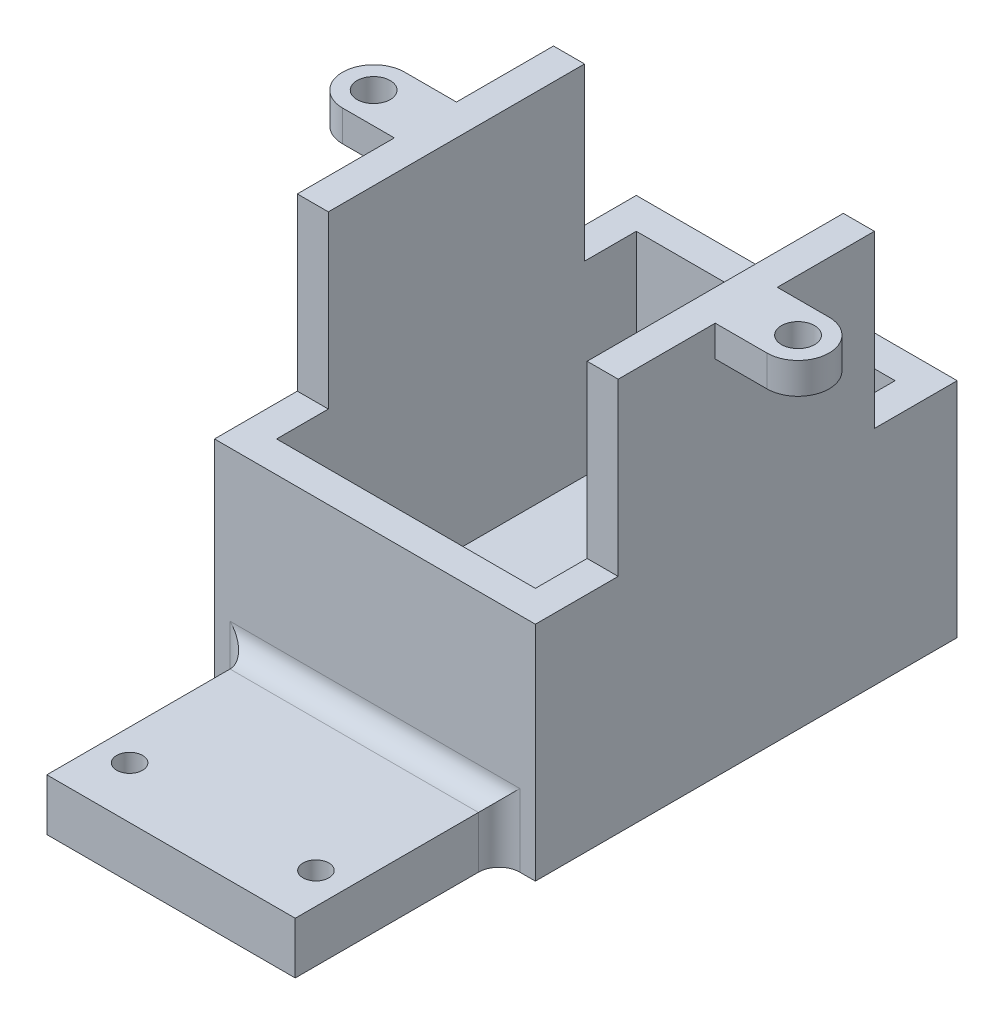
ISO-10303-21;
HEADER;
FILE_DESCRIPTION(('STEP AP214'),'2;1');
FILE_NAME('part.step','',(''),(''),'','','');
FILE_SCHEMA(('AUTOMOTIVE_DESIGN { 1 0 10303 214 1 1 1 1 }'));
ENDSEC;
DATA;
#1=APPLICATION_CONTEXT('core data for automotive mechanical design processes');
#2=APPLICATION_PROTOCOL_DEFINITION('international standard','automotive_design',2000,#1);
#3=PRODUCT_CONTEXT('',#1,'mechanical');
#4=PRODUCT('Part','Part','',(#3));
#5=PRODUCT_RELATED_PRODUCT_CATEGORY('part','',(#4));
#6=PRODUCT_DEFINITION_FORMATION('','',#4);
#7=PRODUCT_DEFINITION_CONTEXT('part definition',#1,'design');
#8=PRODUCT_DEFINITION('design','',#6,#7);
#9=PRODUCT_DEFINITION_SHAPE('','',#8);
#10=(LENGTH_UNIT() NAMED_UNIT(*) SI_UNIT(.MILLI.,.METRE.));
#11=(NAMED_UNIT(*) PLANE_ANGLE_UNIT() SI_UNIT($,.RADIAN.));
#12=(NAMED_UNIT(*) SI_UNIT($,.STERADIAN.) SOLID_ANGLE_UNIT());
#13=UNCERTAINTY_MEASURE_WITH_UNIT(LENGTH_MEASURE(1.E-05),#10,'distance_accuracy_value','');
#14=(GEOMETRIC_REPRESENTATION_CONTEXT(3) GLOBAL_UNCERTAINTY_ASSIGNED_CONTEXT((#13)) GLOBAL_UNIT_ASSIGNED_CONTEXT((#10,
#11,#12)) REPRESENTATION_CONTEXT('',''));
#15=CARTESIAN_POINT('',(0.,0.,0.));
#16=DIRECTION('',(0.,0.,1.));
#17=DIRECTION('',(1.,0.,0.));
#18=AXIS2_PLACEMENT_3D('',#15,#16,#17);
#19=CARTESIAN_POINT('',(0.,38.,-40.75));
#20=DIRECTION('',(0.,1.,0.));
#21=DIRECTION('',(0.,0.,1.));
#22=AXIS2_PLACEMENT_3D('',#19,#20,#21);
#23=PLANE('',#22);
#24=CARTESIAN_POINT('',(-5.,38.,-20.375));
#25=DIRECTION('',(0.,1.,0.));
#26=DIRECTION('',(0.,0.,-1.));
#27=AXIS2_PLACEMENT_3D('',#24,#25,#26);
#28=CIRCLE('',#27,1.6);
#29=CARTESIAN_POINT('',(-5.,38.,-21.975));
#30=VERTEX_POINT('',#29);
#31=EDGE_CURVE('E329',#30,#30,#28,.T.);
#32=ORIENTED_EDGE('',*,*,#31,.F.);
#33=EDGE_LOOP('',(#32));
#34=FACE_BOUND('',#33,.T.);
#35=DIRECTION('',(0.,0.,1.));
#36=VECTOR('',#35,1.);
#37=CARTESIAN_POINT('',(0.,38.,-40.75));
#38=LINE('',#37,#36);
#39=CARTESIAN_POINT('',(0.,38.,-17.375));
#40=VERTEX_POINT('',#39);
#41=CARTESIAN_POINT('',(0.,38.,-8.));
#42=VERTEX_POINT('',#41);
#43=EDGE_CURVE('E524',#40,#42,#38,.T.);
#44=ORIENTED_EDGE('',*,*,#43,.T.);
#45=DIRECTION('',(-1.,0.,0.));
#46=VECTOR('',#45,1.);
#47=CARTESIAN_POINT('',(0.,38.,-8.));
#48=LINE('',#47,#46);
#49=CARTESIAN_POINT('',(3.,38.,-8.));
#50=VERTEX_POINT('',#49);
#51=EDGE_CURVE('E254',#50,#42,#48,.T.);
#52=ORIENTED_EDGE('',*,*,#51,.F.);
#53=DIRECTION('',(0.,0.,1.));
#54=VECTOR('',#53,1.);
#55=CARTESIAN_POINT('',(3.,38.,-3.00000000000003));
#56=LINE('',#55,#54);
#57=CARTESIAN_POINT('',(2.99999999999999,38.,-32.75));
#58=VERTEX_POINT('',#57);
#59=EDGE_CURVE('E432',#58,#50,#56,.T.);
#60=ORIENTED_EDGE('',*,*,#59,.F.);
#61=DIRECTION('',(1.,0.,0.));
#62=VECTOR('',#61,1.);
#63=CARTESIAN_POINT('',(-9.75,38.,-32.75));
#64=LINE('',#63,#62);
#65=CARTESIAN_POINT('',(0.,38.,-32.75));
#66=VERTEX_POINT('',#65);
#67=EDGE_CURVE('E487',#66,#58,#64,.T.);
#68=ORIENTED_EDGE('',*,*,#67,.F.);
#69=CARTESIAN_POINT('',(0.,38.,-23.375));
#70=VERTEX_POINT('',#69);
#71=EDGE_CURVE('E519',#66,#70,#38,.T.);
#72=ORIENTED_EDGE('',*,*,#71,.T.);
#73=DIRECTION('',(-1.,0.,0.));
#74=VECTOR('',#73,1.);
#75=CARTESIAN_POINT('',(-5.,38.,-23.375));
#76=LINE('',#75,#74);
#77=CARTESIAN_POINT('',(-5.,38.,-23.375));
#78=VERTEX_POINT('',#77);
#79=EDGE_CURVE('E334',#70,#78,#76,.T.);
#80=ORIENTED_EDGE('',*,*,#79,.T.);
#81=CARTESIAN_POINT('',(-5.,38.,-20.375));
#82=DIRECTION('',(0.,1.,0.));
#83=DIRECTION('',(0.,0.,-1.));
#84=AXIS2_PLACEMENT_3D('',#81,#82,#83);
#85=CIRCLE('',#84,3.);
#86=CARTESIAN_POINT('',(-5.,38.,-17.375));
#87=VERTEX_POINT('',#86);
#88=EDGE_CURVE('E358',#78,#87,#85,.T.);
#89=ORIENTED_EDGE('',*,*,#88,.T.);
#90=DIRECTION('',(1.,0.,0.));
#91=VECTOR('',#90,1.);
#92=CARTESIAN_POINT('',(0.,38.,-17.375));
#93=LINE('',#92,#91);
#94=EDGE_CURVE('E343',#87,#40,#93,.T.);
#95=ORIENTED_EDGE('',*,*,#94,.T.);
#96=EDGE_LOOP('',(#44,#52,#60,#68,#72,#80,#89,#95));
#97=FACE_BOUND('',#96,.T.);
#98=ADVANCED_FACE('F38',(#34,#97),#23,.T.);
#99=CARTESIAN_POINT('',(36.,38.,-20.375));
#100=DIRECTION('',(0.,1.,0.));
#101=DIRECTION('',(0.,0.,1.));
#102=AXIS2_PLACEMENT_3D('',#99,#100,#101);
#103=CIRCLE('',#102,1.6);
#104=CARTESIAN_POINT('',(36.,38.,-18.775));
#105=VERTEX_POINT('',#104);
#106=EDGE_CURVE('E369',#105,#105,#103,.T.);
#107=ORIENTED_EDGE('',*,*,#106,.F.);
#108=EDGE_LOOP('',(#107));
#109=FACE_BOUND('',#108,.T.);
#110=DIRECTION('',(0.,0.,-1.));
#111=VECTOR('',#110,1.);
#112=CARTESIAN_POINT('',(28.,38.,-3.00000000000003));
#113=LINE('',#112,#111);
#114=CARTESIAN_POINT('',(28.,38.,-8.));
#115=VERTEX_POINT('',#114);
#116=CARTESIAN_POINT('',(28.,38.,-32.75));
#117=VERTEX_POINT('',#116);
#118=EDGE_CURVE('E417',#115,#117,#113,.T.);
#119=ORIENTED_EDGE('',*,*,#118,.F.);
#120=CARTESIAN_POINT('',(31.,38.,-8.));
#121=VERTEX_POINT('',#120);
#122=EDGE_CURVE('E267',#121,#115,#48,.T.);
#123=ORIENTED_EDGE('',*,*,#122,.F.);
#124=DIRECTION('',(0.,0.,1.));
#125=VECTOR('',#124,1.);
#126=CARTESIAN_POINT('',(31.,38.,-40.75));
#127=LINE('',#126,#125);
#128=CARTESIAN_POINT('',(31.,38.,-17.375));
#129=VERTEX_POINT('',#128);
#130=EDGE_CURVE('E529',#129,#121,#127,.T.);
#131=ORIENTED_EDGE('',*,*,#130,.F.);
#132=DIRECTION('',(1.,0.,0.));
#133=VECTOR('',#132,1.);
#134=CARTESIAN_POINT('',(31.,38.,-17.375));
#135=LINE('',#134,#133);
#136=CARTESIAN_POINT('',(36.,38.,-17.375));
#137=VERTEX_POINT('',#136);
#138=EDGE_CURVE('E391',#129,#137,#135,.T.);
#139=ORIENTED_EDGE('',*,*,#138,.T.);
#140=CARTESIAN_POINT('',(36.,38.,-20.375));
#141=DIRECTION('',(0.,1.,0.));
#142=DIRECTION('',(0.,0.,1.));
#143=AXIS2_PLACEMENT_3D('',#140,#141,#142);
#144=CIRCLE('',#143,3.);
#145=CARTESIAN_POINT('',(36.,38.,-23.375));
#146=VERTEX_POINT('',#145);
#147=EDGE_CURVE('E382',#137,#146,#144,.T.);
#148=ORIENTED_EDGE('',*,*,#147,.T.);
#149=DIRECTION('',(-1.,0.,0.));
#150=VECTOR('',#149,1.);
#151=CARTESIAN_POINT('',(36.,38.,-23.375));
#152=LINE('',#151,#150);
#153=CARTESIAN_POINT('',(31.,38.,-23.375));
#154=VERTEX_POINT('',#153);
#155=EDGE_CURVE('E407',#146,#154,#152,.T.);
#156=ORIENTED_EDGE('',*,*,#155,.T.);
#157=CARTESIAN_POINT('',(31.,38.,-32.75));
#158=VERTEX_POINT('',#157);
#159=EDGE_CURVE('E525',#158,#154,#127,.T.);
#160=ORIENTED_EDGE('',*,*,#159,.F.);
#161=EDGE_CURVE('E480',#117,#158,#64,.T.);
#162=ORIENTED_EDGE('',*,*,#161,.F.);
#163=EDGE_LOOP('',(#119,#123,#131,#139,#148,#156,#160,#162));
#164=FACE_BOUND('',#163,.T.);
#165=ADVANCED_FACE('F656',(#109,#164),#23,.T.);
#166=CARTESIAN_POINT('',(0.,0.,0.));
#167=DIRECTION('',(0.,0.,-1.));
#168=DIRECTION('',(-1.,0.,0.));
#169=AXIS2_PLACEMENT_3D('',#166,#167,#168);
#170=PLANE('',#169);
#171=DIRECTION('',(0.,1.,0.));
#172=VECTOR('',#171,1.);
#173=CARTESIAN_POINT('',(31.,0.,0.));
#174=LINE('',#173,#172);
#175=CARTESIAN_POINT('',(31.,0.,0.));
#176=VERTEX_POINT('',#175);
#177=CARTESIAN_POINT('',(31.,21.5,0.));
#178=VERTEX_POINT('',#177);
#179=EDGE_CURVE('E500',#176,#178,#174,.T.);
#180=ORIENTED_EDGE('',*,*,#179,.T.);
#181=DIRECTION('',(1.,0.,0.));
#182=VECTOR('',#181,1.);
#183=CARTESIAN_POINT('',(0.,21.5,0.));
#184=LINE('',#183,#182);
#185=CARTESIAN_POINT('',(0.,21.5,0.));
#186=VERTEX_POINT('',#185);
#187=EDGE_CURVE('E259',#186,#178,#184,.T.);
#188=ORIENTED_EDGE('',*,*,#187,.F.);
#189=DIRECTION('',(0.,-1.,0.));
#190=VECTOR('',#189,1.);
#191=CARTESIAN_POINT('',(0.,0.,0.));
#192=LINE('',#191,#190);
#193=CARTESIAN_POINT('',(0.,0.,0.));
#194=VERTEX_POINT('',#193);
#195=EDGE_CURVE('E264',#186,#194,#192,.T.);
#196=ORIENTED_EDGE('',*,*,#195,.T.);
#197=DIRECTION('',(1.,0.,0.));
#198=VECTOR('',#197,1.);
#199=CARTESIAN_POINT('',(0.,0.,0.));
#200=LINE('',#199,#198);
#201=CARTESIAN_POINT('',(1.5,0.,0.));
#202=VERTEX_POINT('',#201);
#203=EDGE_CURVE('E512',#194,#202,#200,.T.);
#204=ORIENTED_EDGE('',*,*,#203,.T.);
#205=DIRECTION('',(0.,-1.,0.));
#206=VECTOR('',#205,1.);
#207=CARTESIAN_POINT('',(1.5,5.,0.));
#208=LINE('',#207,#206);
#209=CARTESIAN_POINT('',(1.5,7.,0.));
#210=VERTEX_POINT('',#209);
#211=EDGE_CURVE('E560',#202,#210,#208,.F.);
#212=ORIENTED_EDGE('',*,*,#211,.T.);
#213=DIRECTION('',(-1.,0.,0.));
#214=VECTOR('',#213,1.);
#215=CARTESIAN_POINT('',(27.5,7.,0.));
#216=LINE('',#215,#214);
#217=CARTESIAN_POINT('',(29.5,7.,0.));
#218=VERTEX_POINT('',#217);
#219=EDGE_CURVE('E557',#210,#218,#216,.F.);
#220=ORIENTED_EDGE('',*,*,#219,.T.);
#221=DIRECTION('',(0.,1.,0.));
#222=VECTOR('',#221,1.);
#223=CARTESIAN_POINT('',(29.5,0.,0.));
#224=LINE('',#223,#222);
#225=CARTESIAN_POINT('',(29.5,0.,0.));
#226=VERTEX_POINT('',#225);
#227=EDGE_CURVE('E554',#218,#226,#224,.F.);
#228=ORIENTED_EDGE('',*,*,#227,.T.);
#229=EDGE_CURVE('E511',#226,#176,#200,.T.);
#230=ORIENTED_EDGE('',*,*,#229,.T.);
#231=EDGE_LOOP('',(#180,#188,#196,#204,#212,#220,#228,#230));
#232=FACE_BOUND('',#231,.T.);
#233=ADVANCED_FACE('F607',(#232),#170,.F.);
#234=CARTESIAN_POINT('',(-9.75,38.,-32.75));
#235=DIRECTION('',(0.,0.,1.));
#236=DIRECTION('',(0.,-1.,0.));
#237=AXIS2_PLACEMENT_3D('',#234,#235,#236);
#238=PLANE('',#237);
#239=DIRECTION('',(1.,0.,0.));
#240=VECTOR('',#239,1.);
#241=CARTESIAN_POINT('',(-9.75,21.5,-32.75));
#242=LINE('',#241,#240);
#243=CARTESIAN_POINT('',(28.,21.5,-32.75));
#244=VERTEX_POINT('',#243);
#245=CARTESIAN_POINT('',(31.,21.5,-32.75));
#246=VERTEX_POINT('',#245);
#247=EDGE_CURVE('E486',#244,#246,#242,.T.);
#248=ORIENTED_EDGE('',*,*,#247,.F.);
#249=DIRECTION('',(0.,1.,0.));
#250=VECTOR('',#249,1.);
#251=CARTESIAN_POINT('',(28.,38.,-32.75));
#252=LINE('',#251,#250);
#253=EDGE_CURVE('E542',#244,#117,#252,.T.);
#254=ORIENTED_EDGE('',*,*,#253,.T.);
#255=ORIENTED_EDGE('',*,*,#161,.T.);
#256=DIRECTION('',(0.,-1.,0.));
#257=VECTOR('',#256,1.);
#258=CARTESIAN_POINT('',(31.,38.,-32.75));
#259=LINE('',#258,#257);
#260=EDGE_CURVE('E473',#158,#246,#259,.T.);
#261=ORIENTED_EDGE('',*,*,#260,.T.);
#262=EDGE_LOOP('',(#248,#254,#255,#261));
#263=FACE_BOUND('',#262,.T.);
#264=ADVANCED_FACE('F651',(#263),#238,.F.);
#265=CARTESIAN_POINT('',(0.,0.,-40.75));
#266=DIRECTION('',(-1.,0.,0.));
#267=DIRECTION('',(0.,0.,1.));
#268=AXIS2_PLACEMENT_3D('',#265,#266,#267);
#269=PLANE('',#268);
#270=DIRECTION('',(0.,0.,1.));
#271=VECTOR('',#270,1.);
#272=CARTESIAN_POINT('',(0.,21.5,-8.));
#273=LINE('',#272,#271);
#274=CARTESIAN_POINT('',(0.,21.5,-8.));
#275=VERTEX_POINT('',#274);
#276=EDGE_CURVE('E240',#275,#186,#273,.T.);
#277=ORIENTED_EDGE('',*,*,#276,.F.);
#278=DIRECTION('',(0.,-1.,0.));
#279=VECTOR('',#278,1.);
#280=CARTESIAN_POINT('',(0.,38.,-8.));
#281=LINE('',#280,#279);
#282=EDGE_CURVE('E251',#42,#275,#281,.T.);
#283=ORIENTED_EDGE('',*,*,#282,.F.);
#284=ORIENTED_EDGE('',*,*,#43,.F.);
#285=DIRECTION('',(0.,1.,0.));
#286=VECTOR('',#285,1.);
#287=CARTESIAN_POINT('',(0.,35.,-17.375));
#288=LINE('',#287,#286);
#289=CARTESIAN_POINT('',(0.,35.,-17.375));
#290=VERTEX_POINT('',#289);
#291=EDGE_CURVE('E370',#290,#40,#288,.T.);
#292=ORIENTED_EDGE('',*,*,#291,.F.);
#293=DIRECTION('',(0.,0.,-1.));
#294=VECTOR('',#293,1.);
#295=CARTESIAN_POINT('',(0.,35.,-23.375));
#296=LINE('',#295,#294);
#297=CARTESIAN_POINT('',(0.,35.,-23.375));
#298=VERTEX_POINT('',#297);
#299=EDGE_CURVE('E350',#290,#298,#296,.T.);
#300=ORIENTED_EDGE('',*,*,#299,.T.);
#301=DIRECTION('',(0.,1.,0.));
#302=VECTOR('',#301,1.);
#303=CARTESIAN_POINT('',(0.,35.,-23.375));
#304=LINE('',#303,#302);
#305=EDGE_CURVE('E365',#298,#70,#304,.T.);
#306=ORIENTED_EDGE('',*,*,#305,.T.);
#307=ORIENTED_EDGE('',*,*,#71,.F.);
#308=DIRECTION('',(0.,1.,0.));
#309=VECTOR('',#308,1.);
#310=CARTESIAN_POINT('',(0.,0.,-32.75));
#311=LINE('',#310,#309);
#312=CARTESIAN_POINT('',(0.,21.5,-32.75));
#313=VERTEX_POINT('',#312);
#314=EDGE_CURVE('E493',#313,#66,#311,.T.);
#315=ORIENTED_EDGE('',*,*,#314,.F.);
#316=DIRECTION('',(0.,0.,1.));
#317=VECTOR('',#316,1.);
#318=CARTESIAN_POINT('',(0.,21.5,-40.75));
#319=LINE('',#318,#317);
#320=CARTESIAN_POINT('',(0.,21.5,-40.75));
#321=VERTEX_POINT('',#320);
#322=EDGE_CURVE('E485',#321,#313,#319,.T.);
#323=ORIENTED_EDGE('',*,*,#322,.F.);
#324=DIRECTION('',(0.,-1.,0.));
#325=VECTOR('',#324,1.);
#326=CARTESIAN_POINT('',(0.,0.,-40.75));
#327=LINE('',#326,#325);
#328=CARTESIAN_POINT('',(0.,0.,-40.75));
#329=VERTEX_POINT('',#328);
#330=EDGE_CURVE('E496',#321,#329,#327,.T.);
#331=ORIENTED_EDGE('',*,*,#330,.T.);
#332=DIRECTION('',(0.,0.,1.));
#333=VECTOR('',#332,1.);
#334=CARTESIAN_POINT('',(0.,0.,-40.75));
#335=LINE('',#334,#333);
#336=EDGE_CURVE('E508',#329,#194,#335,.T.);
#337=ORIENTED_EDGE('',*,*,#336,.T.);
#338=ORIENTED_EDGE('',*,*,#195,.F.);
#339=EDGE_LOOP('',(#277,#283,#284,#292,#300,#306,#307,#315,#323,#331,#337,#338));
#340=FACE_BOUND('',#339,.T.);
#341=ADVANCED_FACE('F262',(#340),#269,.T.);
#342=CARTESIAN_POINT('',(31.,0.,-40.75));
#343=DIRECTION('',(1.,0.,0.));
#344=DIRECTION('',(0.,0.,-1.));
#345=AXIS2_PLACEMENT_3D('',#342,#343,#344);
#346=PLANE('',#345);
#347=DIRECTION('',(0.,0.,1.));
#348=VECTOR('',#347,1.);
#349=CARTESIAN_POINT('',(31.,21.5,-8.));
#350=LINE('',#349,#348);
#351=CARTESIAN_POINT('',(31.,21.5,-8.));
#352=VERTEX_POINT('',#351);
#353=EDGE_CURVE('E266',#352,#178,#350,.T.);
#354=ORIENTED_EDGE('',*,*,#353,.T.);
#355=ORIENTED_EDGE('',*,*,#179,.F.);
#356=DIRECTION('',(0.,0.,1.));
#357=VECTOR('',#356,1.);
#358=CARTESIAN_POINT('',(31.,0.,-40.75));
#359=LINE('',#358,#357);
#360=CARTESIAN_POINT('',(31.,0.,-40.75));
#361=VERTEX_POINT('',#360);
#362=EDGE_CURVE('E530',#361,#176,#359,.T.);
#363=ORIENTED_EDGE('',*,*,#362,.F.);
#364=DIRECTION('',(0.,1.,0.));
#365=VECTOR('',#364,1.);
#366=CARTESIAN_POINT('',(31.,0.,-40.75));
#367=LINE('',#366,#365);
#368=CARTESIAN_POINT('',(31.,21.5,-40.75));
#369=VERTEX_POINT('',#368);
#370=EDGE_CURVE('E504',#361,#369,#367,.T.);
#371=ORIENTED_EDGE('',*,*,#370,.T.);
#372=DIRECTION('',(0.,0.,-1.));
#373=VECTOR('',#372,1.);
#374=CARTESIAN_POINT('',(31.,21.5,-40.75));
#375=LINE('',#374,#373);
#376=EDGE_CURVE('E477',#246,#369,#375,.T.);
#377=ORIENTED_EDGE('',*,*,#376,.F.);
#378=ORIENTED_EDGE('',*,*,#260,.F.);
#379=ORIENTED_EDGE('',*,*,#159,.T.);
#380=DIRECTION('',(0.,1.,0.));
#381=VECTOR('',#380,1.);
#382=CARTESIAN_POINT('',(31.,35.,-23.375));
#383=LINE('',#382,#381);
#384=CARTESIAN_POINT('',(31.,35.,-23.375));
#385=VERTEX_POINT('',#384);
#386=EDGE_CURVE('E422',#385,#154,#383,.T.);
#387=ORIENTED_EDGE('',*,*,#386,.F.);
#388=DIRECTION('',(0.,0.,1.));
#389=VECTOR('',#388,1.);
#390=CARTESIAN_POINT('',(31.,35.,-23.375));
#391=LINE('',#390,#389);
#392=CARTESIAN_POINT('',(31.,35.,-17.375));
#393=VERTEX_POINT('',#392);
#394=EDGE_CURVE('E395',#385,#393,#391,.T.);
#395=ORIENTED_EDGE('',*,*,#394,.T.);
#396=DIRECTION('',(0.,1.,0.));
#397=VECTOR('',#396,1.);
#398=CARTESIAN_POINT('',(31.,35.,-17.375));
#399=LINE('',#398,#397);
#400=EDGE_CURVE('E418',#393,#129,#399,.T.);
#401=ORIENTED_EDGE('',*,*,#400,.T.);
#402=ORIENTED_EDGE('',*,*,#130,.T.);
#403=DIRECTION('',(0.,1.,0.));
#404=VECTOR('',#403,1.);
#405=CARTESIAN_POINT('',(31.,38.,-8.));
#406=LINE('',#405,#404);
#407=EDGE_CURVE('E247',#352,#121,#406,.T.);
#408=ORIENTED_EDGE('',*,*,#407,.F.);
#409=EDGE_LOOP('',(#354,#355,#363,#371,#377,#378,#379,#387,#395,#401,#402,#408));
#410=FACE_BOUND('',#409,.T.);
#411=ADVANCED_FACE('F605',(#410),#346,.T.);
#412=CARTESIAN_POINT('',(0.,0.,-40.75));
#413=DIRECTION('',(0.,-1.,0.));
#414=DIRECTION('',(0.,0.,-1.));
#415=AXIS2_PLACEMENT_3D('',#412,#413,#414);
#416=PLANE('',#415);
#417=CARTESIAN_POINT('',(6.50000000000203,0.,14.7));
#418=DIRECTION('',(0.,-1.,0.));
#419=DIRECTION('',(0.,0.,-1.));
#420=AXIS2_PLACEMENT_3D('',#417,#418,#419);
#421=CIRCLE('',#420,1.25);
#422=CARTESIAN_POINT('',(6.50000000000203,0.,13.45));
#423=VERTEX_POINT('',#422);
#424=EDGE_CURVE('E295',#423,#423,#421,.T.);
#425=ORIENTED_EDGE('',*,*,#424,.F.);
#426=EDGE_LOOP('',(#425));
#427=FACE_BOUND('',#426,.T.);
#428=CARTESIAN_POINT('',(24.500000000002,0.,14.7));
#429=DIRECTION('',(0.,-1.,0.));
#430=DIRECTION('',(0.,0.,-1.));
#431=AXIS2_PLACEMENT_3D('',#428,#429,#430);
#432=CIRCLE('',#431,1.25);
#433=CARTESIAN_POINT('',(24.500000000002,0.,13.45));
#434=VERTEX_POINT('',#433);
#435=EDGE_CURVE('E288',#434,#434,#432,.T.);
#436=ORIENTED_EDGE('',*,*,#435,.F.);
#437=EDGE_LOOP('',(#436));
#438=FACE_BOUND('',#437,.T.);
#439=ORIENTED_EDGE('',*,*,#203,.F.);
#440=ORIENTED_EDGE('',*,*,#336,.F.);
#441=DIRECTION('',(1.,0.,0.));
#442=VECTOR('',#441,1.);
#443=CARTESIAN_POINT('',(0.,0.,-40.75));
#444=LINE('',#443,#442);
#445=EDGE_CURVE('E499',#329,#361,#444,.T.);
#446=ORIENTED_EDGE('',*,*,#445,.T.);
#447=ORIENTED_EDGE('',*,*,#362,.T.);
#448=ORIENTED_EDGE('',*,*,#229,.F.);
#449=CARTESIAN_POINT('',(29.5,0.,2.));
#450=DIRECTION('',(0.,-1.,0.));
#451=DIRECTION('',(0.,0.,-1.));
#452=AXIS2_PLACEMENT_3D('',#449,#450,#451);
#453=CIRCLE('',#452,2.);
#454=CARTESIAN_POINT('',(27.5,0.,2.));
#455=VERTEX_POINT('',#454);
#456=EDGE_CURVE('E62',#226,#455,#453,.F.);
#457=ORIENTED_EDGE('',*,*,#456,.T.);
#458=DIRECTION('',(0.,0.,-1.));
#459=VECTOR('',#458,1.);
#460=CARTESIAN_POINT('',(27.5,0.,19.7));
#461=LINE('',#460,#459);
#462=CARTESIAN_POINT('',(27.5,0.,19.7));
#463=VERTEX_POINT('',#462);
#464=EDGE_CURVE('E322',#463,#455,#461,.T.);
#465=ORIENTED_EDGE('',*,*,#464,.F.);
#466=DIRECTION('',(1.,0.,0.));
#467=VECTOR('',#466,1.);
#468=CARTESIAN_POINT('',(3.5,0.,19.7));
#469=LINE('',#468,#467);
#470=CARTESIAN_POINT('',(3.5,0.,19.7));
#471=VERTEX_POINT('',#470);
#472=EDGE_CURVE('E304',#471,#463,#469,.T.);
#473=ORIENTED_EDGE('',*,*,#472,.F.);
#474=DIRECTION('',(0.,0.,-1.));
#475=VECTOR('',#474,1.);
#476=CARTESIAN_POINT('',(3.5,0.,19.7));
#477=LINE('',#476,#475);
#478=CARTESIAN_POINT('',(3.5,0.,2.));
#479=VERTEX_POINT('',#478);
#480=EDGE_CURVE('E325',#471,#479,#477,.T.);
#481=ORIENTED_EDGE('',*,*,#480,.T.);
#482=CARTESIAN_POINT('',(1.5,0.,2.));
#483=DIRECTION('',(0.,-1.,0.));
#484=DIRECTION('',(0.,0.,-1.));
#485=AXIS2_PLACEMENT_3D('',#482,#483,#484);
#486=CIRCLE('',#485,2.);
#487=EDGE_CURVE('E569',#479,#202,#486,.F.);
#488=ORIENTED_EDGE('',*,*,#487,.T.);
#489=EDGE_LOOP('',(#439,#440,#446,#447,#448,#457,#465,#473,#481,#488));
#490=FACE_BOUND('',#489,.T.);
#491=ADVANCED_FACE('F611',(#427,#438,#490),#416,.T.);
#492=CARTESIAN_POINT('',(0.,0.,-40.75));
#493=DIRECTION('',(0.,0.,-1.));
#494=DIRECTION('',(-1.,0.,0.));
#495=AXIS2_PLACEMENT_3D('',#492,#493,#494);
#496=PLANE('',#495);
#497=DIRECTION('',(-1.,0.,0.));
#498=VECTOR('',#497,1.);
#499=CARTESIAN_POINT('',(0.,21.5,-40.75));
#500=LINE('',#499,#498);
#501=EDGE_CURVE('E523',#369,#321,#500,.T.);
#502=ORIENTED_EDGE('',*,*,#501,.F.);
#503=ORIENTED_EDGE('',*,*,#370,.F.);
#504=ORIENTED_EDGE('',*,*,#445,.F.);
#505=ORIENTED_EDGE('',*,*,#330,.F.);
#506=EDGE_LOOP('',(#502,#503,#504,#505));
#507=FACE_BOUND('',#506,.T.);
#508=ADVANCED_FACE('F618',(#507),#496,.T.);
#509=CARTESIAN_POINT('',(-9.75,21.5,-40.75));
#510=DIRECTION('',(0.,-1.,0.));
#511=DIRECTION('',(0.,0.,-1.));
#512=AXIS2_PLACEMENT_3D('',#509,#510,#511);
#513=PLANE('',#512);
#514=DIRECTION('',(1.,0.,0.));
#515=VECTOR('',#514,1.);
#516=CARTESIAN_POINT('',(-9.75,21.5,-37.75));
#517=LINE('',#516,#515);
#518=CARTESIAN_POINT('',(2.99999999999999,21.5,-37.75));
#519=VERTEX_POINT('',#518);
#520=CARTESIAN_POINT('',(28.,21.5,-37.75));
#521=VERTEX_POINT('',#520);
#522=EDGE_CURVE('E546',#519,#521,#517,.T.);
#523=ORIENTED_EDGE('',*,*,#522,.T.);
#524=DIRECTION('',(0.,0.,1.));
#525=VECTOR('',#524,1.);
#526=CARTESIAN_POINT('',(28.,21.5,-40.75));
#527=LINE('',#526,#525);
#528=EDGE_CURVE('E469',#521,#244,#527,.T.);
#529=ORIENTED_EDGE('',*,*,#528,.T.);
#530=ORIENTED_EDGE('',*,*,#247,.T.);
#531=ORIENTED_EDGE('',*,*,#376,.T.);
#532=ORIENTED_EDGE('',*,*,#501,.T.);
#533=ORIENTED_EDGE('',*,*,#322,.T.);
#534=CARTESIAN_POINT('',(2.99999999999999,21.5,-32.75));
#535=VERTEX_POINT('',#534);
#536=EDGE_CURVE('E481',#313,#535,#242,.T.);
#537=ORIENTED_EDGE('',*,*,#536,.T.);
#538=DIRECTION('',(0.,0.,-1.));
#539=VECTOR('',#538,1.);
#540=CARTESIAN_POINT('',(2.99999999999999,21.5,-40.75));
#541=LINE('',#540,#539);
#542=EDGE_CURVE('E454',#535,#519,#541,.T.);
#543=ORIENTED_EDGE('',*,*,#542,.T.);
#544=EDGE_LOOP('',(#523,#529,#530,#531,#532,#533,#537,#543));
#545=FACE_BOUND('',#544,.T.);
#546=ADVANCED_FACE('F622',(#545),#513,.F.);
#547=ORIENTED_EDGE('',*,*,#67,.T.);
#548=DIRECTION('',(0.,-1.,0.));
#549=VECTOR('',#548,1.);
#550=CARTESIAN_POINT('',(2.99999999999999,38.,-32.75));
#551=LINE('',#550,#549);
#552=EDGE_CURVE('E538',#58,#535,#551,.T.);
#553=ORIENTED_EDGE('',*,*,#552,.T.);
#554=ORIENTED_EDGE('',*,*,#536,.F.);
#555=ORIENTED_EDGE('',*,*,#314,.T.);
#556=EDGE_LOOP('',(#547,#553,#554,#555));
#557=FACE_BOUND('',#556,.T.);
#558=ADVANCED_FACE('F627',(#557),#238,.F.);
#559=CARTESIAN_POINT('',(2.99999999999999,3.5,-37.75));
#560=DIRECTION('',(0.,0.,-1.));
#561=DIRECTION('',(-1.,0.,0.));
#562=AXIS2_PLACEMENT_3D('',#559,#560,#561);
#563=PLANE('',#562);
#564=DIRECTION('',(0.,1.,0.));
#565=VECTOR('',#564,1.);
#566=CARTESIAN_POINT('',(2.99999999999999,3.5,-37.75));
#567=LINE('',#566,#565);
#568=CARTESIAN_POINT('',(2.99999999999999,3.5,-37.75));
#569=VERTEX_POINT('',#568);
#570=EDGE_CURVE('E459',#569,#519,#567,.T.);
#571=ORIENTED_EDGE('',*,*,#570,.F.);
#572=DIRECTION('',(-1.,0.,0.));
#573=VECTOR('',#572,1.);
#574=CARTESIAN_POINT('',(2.99999999999999,3.5,-37.75));
#575=LINE('',#574,#573);
#576=CARTESIAN_POINT('',(28.,3.5,-37.75));
#577=VERTEX_POINT('',#576);
#578=EDGE_CURVE('E431',#577,#569,#575,.T.);
#579=ORIENTED_EDGE('',*,*,#578,.F.);
#580=DIRECTION('',(0.,1.,0.));
#581=VECTOR('',#580,1.);
#582=CARTESIAN_POINT('',(28.,3.5,-37.75));
#583=LINE('',#582,#581);
#584=EDGE_CURVE('E444',#577,#521,#583,.T.);
#585=ORIENTED_EDGE('',*,*,#584,.T.);
#586=ORIENTED_EDGE('',*,*,#522,.F.);
#587=EDGE_LOOP('',(#571,#579,#585,#586));
#588=FACE_BOUND('',#587,.T.);
#589=ADVANCED_FACE('F673',(#588),#563,.F.);
#590=CARTESIAN_POINT('',(28.,3.5,-3.00000000000003));
#591=DIRECTION('',(1.,0.,0.));
#592=DIRECTION('',(0.,0.,-1.));
#593=AXIS2_PLACEMENT_3D('',#590,#591,#592);
#594=PLANE('',#593);
#595=DIRECTION('',(0.,1.,0.));
#596=VECTOR('',#595,1.);
#597=CARTESIAN_POINT('',(28.,3.5,-3.00000000000003));
#598=LINE('',#597,#596);
#599=CARTESIAN_POINT('',(28.,3.5,-3.00000000000003));
#600=VERTEX_POINT('',#599);
#601=CARTESIAN_POINT('',(28.,21.5,-3.00000000000003));
#602=VERTEX_POINT('',#601);
#603=EDGE_CURVE('E450',#600,#602,#598,.T.);
#604=ORIENTED_EDGE('',*,*,#603,.T.);
#605=DIRECTION('',(0.,0.,-1.));
#606=VECTOR('',#605,1.);
#607=CARTESIAN_POINT('',(28.,21.5,-3.00000000000003));
#608=LINE('',#607,#606);
#609=CARTESIAN_POINT('',(28.,21.5,-8.));
#610=VERTEX_POINT('',#609);
#611=EDGE_CURVE('E54',#602,#610,#608,.T.);
#612=ORIENTED_EDGE('',*,*,#611,.T.);
#613=DIRECTION('',(0.,-1.,0.));
#614=VECTOR('',#613,1.);
#615=CARTESIAN_POINT('',(28.,3.5,-8.));
#616=LINE('',#615,#614);
#617=EDGE_CURVE('E280',#115,#610,#616,.T.);
#618=ORIENTED_EDGE('',*,*,#617,.F.);
#619=ORIENTED_EDGE('',*,*,#118,.T.);
#620=ORIENTED_EDGE('',*,*,#253,.F.);
#621=ORIENTED_EDGE('',*,*,#528,.F.);
#622=ORIENTED_EDGE('',*,*,#584,.F.);
#623=DIRECTION('',(0.,0.,-1.));
#624=VECTOR('',#623,1.);
#625=CARTESIAN_POINT('',(28.,3.5,-3.00000000000003));
#626=LINE('',#625,#624);
#627=EDGE_CURVE('E427',#600,#577,#626,.T.);
#628=ORIENTED_EDGE('',*,*,#627,.F.);
#629=EDGE_LOOP('',(#604,#612,#618,#619,#620,#621,#622,#628));
#630=FACE_BOUND('',#629,.T.);
#631=ADVANCED_FACE('F585',(#630),#594,.F.);
#632=CARTESIAN_POINT('',(3.,3.5,-3.00000000000003));
#633=DIRECTION('',(-1.,0.,0.));
#634=DIRECTION('',(0.,0.,1.));
#635=AXIS2_PLACEMENT_3D('',#632,#633,#634);
#636=PLANE('',#635);
#637=DIRECTION('',(0.,1.,0.));
#638=VECTOR('',#637,1.);
#639=CARTESIAN_POINT('',(3.,3.5,-8.));
#640=LINE('',#639,#638);
#641=CARTESIAN_POINT('',(3.,21.5,-8.));
#642=VERTEX_POINT('',#641);
#643=EDGE_CURVE('E11',#642,#50,#640,.T.);
#644=ORIENTED_EDGE('',*,*,#643,.F.);
#645=DIRECTION('',(0.,0.,1.));
#646=VECTOR('',#645,1.);
#647=CARTESIAN_POINT('',(3.,21.5,-3.00000000000003));
#648=LINE('',#647,#646);
#649=CARTESIAN_POINT('',(3.,21.5,-3.00000000000003));
#650=VERTEX_POINT('',#649);
#651=EDGE_CURVE('E243',#642,#650,#648,.T.);
#652=ORIENTED_EDGE('',*,*,#651,.T.);
#653=DIRECTION('',(0.,1.,0.));
#654=VECTOR('',#653,1.);
#655=CARTESIAN_POINT('',(3.,3.5,-3.00000000000003));
#656=LINE('',#655,#654);
#657=CARTESIAN_POINT('',(3.,3.5,-3.00000000000003));
#658=VERTEX_POINT('',#657);
#659=EDGE_CURVE('E455',#658,#650,#656,.T.);
#660=ORIENTED_EDGE('',*,*,#659,.F.);
#661=DIRECTION('',(0.,0.,1.));
#662=VECTOR('',#661,1.);
#663=CARTESIAN_POINT('',(3.,3.5,-3.00000000000003));
#664=LINE('',#663,#662);
#665=EDGE_CURVE('E436',#569,#658,#664,.T.);
#666=ORIENTED_EDGE('',*,*,#665,.F.);
#667=ORIENTED_EDGE('',*,*,#570,.T.);
#668=ORIENTED_EDGE('',*,*,#542,.F.);
#669=ORIENTED_EDGE('',*,*,#552,.F.);
#670=ORIENTED_EDGE('',*,*,#59,.T.);
#671=EDGE_LOOP('',(#644,#652,#660,#666,#667,#668,#669,#670));
#672=FACE_BOUND('',#671,.T.);
#673=ADVANCED_FACE('F592',(#672),#636,.F.);
#674=CARTESIAN_POINT('',(3.,3.5,-3.00000000000003));
#675=DIRECTION('',(0.,0.,1.));
#676=DIRECTION('',(1.,0.,0.));
#677=AXIS2_PLACEMENT_3D('',#674,#675,#676);
#678=PLANE('',#677);
#679=ORIENTED_EDGE('',*,*,#659,.T.);
#680=DIRECTION('',(1.,0.,0.));
#681=VECTOR('',#680,1.);
#682=CARTESIAN_POINT('',(3.,21.5,-3.00000000000003));
#683=LINE('',#682,#681);
#684=EDGE_CURVE('E47',#650,#602,#683,.T.);
#685=ORIENTED_EDGE('',*,*,#684,.T.);
#686=ORIENTED_EDGE('',*,*,#603,.F.);
#687=DIRECTION('',(1.,0.,0.));
#688=VECTOR('',#687,1.);
#689=CARTESIAN_POINT('',(3.,3.5,-3.00000000000003));
#690=LINE('',#689,#688);
#691=EDGE_CURVE('E440',#658,#600,#690,.T.);
#692=ORIENTED_EDGE('',*,*,#691,.F.);
#693=EDGE_LOOP('',(#679,#685,#686,#692));
#694=FACE_BOUND('',#693,.T.);
#695=ADVANCED_FACE('F581',(#694),#678,.F.);
#696=CARTESIAN_POINT('',(0.,3.5,0.));
#697=DIRECTION('',(0.,-1.,0.));
#698=DIRECTION('',(0.,0.,-1.));
#699=AXIS2_PLACEMENT_3D('',#696,#697,#698);
#700=PLANE('',#699);
#701=ORIENTED_EDGE('',*,*,#627,.T.);
#702=ORIENTED_EDGE('',*,*,#578,.T.);
#703=ORIENTED_EDGE('',*,*,#665,.T.);
#704=ORIENTED_EDGE('',*,*,#691,.T.);
#705=EDGE_LOOP('',(#701,#702,#703,#704));
#706=FACE_BOUND('',#705,.T.);
#707=ADVANCED_FACE('F589',(#706),#700,.F.);
#708=CARTESIAN_POINT('',(36.,35.,-20.375));
#709=DIRECTION('',(0.,1.,0.));
#710=DIRECTION('',(0.,0.,1.));
#711=AXIS2_PLACEMENT_3D('',#708,#709,#710);
#712=CYLINDRICAL_SURFACE('',#711,3.);
#713=ORIENTED_EDGE('',*,*,#147,.F.);
#714=DIRECTION('',(0.,1.,0.));
#715=VECTOR('',#714,1.);
#716=CARTESIAN_POINT('',(36.,35.,-17.375));
#717=LINE('',#716,#715);
#718=CARTESIAN_POINT('',(36.,35.,-17.375));
#719=VERTEX_POINT('',#718);
#720=EDGE_CURVE('E414',#719,#137,#717,.T.);
#721=ORIENTED_EDGE('',*,*,#720,.F.);
#722=CARTESIAN_POINT('',(36.,35.,-20.375));
#723=DIRECTION('',(0.,1.,0.));
#724=DIRECTION('',(0.,0.,1.));
#725=AXIS2_PLACEMENT_3D('',#722,#723,#724);
#726=CIRCLE('',#725,3.);
#727=CARTESIAN_POINT('',(36.,35.,-23.375));
#728=VERTEX_POINT('',#727);
#729=EDGE_CURVE('E386',#719,#728,#726,.T.);
#730=ORIENTED_EDGE('',*,*,#729,.T.);
#731=DIRECTION('',(0.,1.,0.));
#732=VECTOR('',#731,1.);
#733=CARTESIAN_POINT('',(36.,35.,-23.375));
#734=LINE('',#733,#732);
#735=EDGE_CURVE('E403',#728,#146,#734,.T.);
#736=ORIENTED_EDGE('',*,*,#735,.T.);
#737=EDGE_LOOP('',(#713,#721,#730,#736));
#738=FACE_BOUND('',#737,.T.);
#739=ADVANCED_FACE('F766',(#738),#712,.T.);
#740=CARTESIAN_POINT('',(31.,35.,-17.375));
#741=DIRECTION('',(0.,0.,1.));
#742=DIRECTION('',(1.,0.,0.));
#743=AXIS2_PLACEMENT_3D('',#740,#741,#742);
#744=PLANE('',#743);
#745=ORIENTED_EDGE('',*,*,#138,.F.);
#746=ORIENTED_EDGE('',*,*,#400,.F.);
#747=DIRECTION('',(1.,0.,0.));
#748=VECTOR('',#747,1.);
#749=CARTESIAN_POINT('',(31.,35.,-17.375));
#750=LINE('',#749,#748);
#751=EDGE_CURVE('E399',#393,#719,#750,.T.);
#752=ORIENTED_EDGE('',*,*,#751,.T.);
#753=ORIENTED_EDGE('',*,*,#720,.T.);
#754=EDGE_LOOP('',(#745,#746,#752,#753));
#755=FACE_BOUND('',#754,.T.);
#756=ADVANCED_FACE('F668',(#755),#744,.T.);
#757=CARTESIAN_POINT('',(36.,35.,-23.375));
#758=DIRECTION('',(0.,0.,-1.));
#759=DIRECTION('',(-1.,0.,0.));
#760=AXIS2_PLACEMENT_3D('',#757,#758,#759);
#761=PLANE('',#760);
#762=ORIENTED_EDGE('',*,*,#155,.F.);
#763=ORIENTED_EDGE('',*,*,#735,.F.);
#764=DIRECTION('',(-1.,0.,0.));
#765=VECTOR('',#764,1.);
#766=CARTESIAN_POINT('',(36.,35.,-23.375));
#767=LINE('',#766,#765);
#768=EDGE_CURVE('E390',#728,#385,#767,.T.);
#769=ORIENTED_EDGE('',*,*,#768,.T.);
#770=ORIENTED_EDGE('',*,*,#386,.T.);
#771=EDGE_LOOP('',(#762,#763,#769,#770));
#772=FACE_BOUND('',#771,.T.);
#773=ADVANCED_FACE('F660',(#772),#761,.T.);
#774=CARTESIAN_POINT('',(36.,35.,-20.375));
#775=DIRECTION('',(0.,1.,0.));
#776=DIRECTION('',(0.,0.,1.));
#777=AXIS2_PLACEMENT_3D('',#774,#775,#776);
#778=PLANE('',#777);
#779=CARTESIAN_POINT('',(36.,35.,-20.375));
#780=DIRECTION('',(0.,1.,0.));
#781=DIRECTION('',(0.,0.,1.));
#782=AXIS2_PLACEMENT_3D('',#779,#780,#781);
#783=CIRCLE('',#782,1.6);
#784=CARTESIAN_POINT('',(36.,35.,-18.775));
#785=VERTEX_POINT('',#784);
#786=EDGE_CURVE('E378',#785,#785,#783,.T.);
#787=ORIENTED_EDGE('',*,*,#786,.T.);
#788=EDGE_LOOP('',(#787));
#789=FACE_BOUND('',#788,.T.);
#790=ORIENTED_EDGE('',*,*,#729,.F.);
#791=ORIENTED_EDGE('',*,*,#751,.F.);
#792=ORIENTED_EDGE('',*,*,#394,.F.);
#793=ORIENTED_EDGE('',*,*,#768,.F.);
#794=EDGE_LOOP('',(#790,#791,#792,#793));
#795=FACE_BOUND('',#794,.T.);
#796=ADVANCED_FACE('F666',(#789,#795),#778,.F.);
#797=CARTESIAN_POINT('',(36.,35.,-20.375));
#798=DIRECTION('',(0.,1.,0.));
#799=DIRECTION('',(0.,0.,1.));
#800=AXIS2_PLACEMENT_3D('',#797,#798,#799);
#801=CYLINDRICAL_SURFACE('',#800,1.6);
#802=ORIENTED_EDGE('',*,*,#786,.F.);
#803=EDGE_LOOP('',(#802));
#804=FACE_BOUND('',#803,.T.);
#805=ORIENTED_EDGE('',*,*,#106,.T.);
#806=EDGE_LOOP('',(#805));
#807=FACE_BOUND('',#806,.T.);
#808=ADVANCED_FACE('F757',(#804,#807),#801,.F.);
#809=CARTESIAN_POINT('',(-5.,35.,-23.375));
#810=DIRECTION('',(0.,0.,-1.));
#811=DIRECTION('',(-1.,0.,0.));
#812=AXIS2_PLACEMENT_3D('',#809,#810,#811);
#813=PLANE('',#812);
#814=ORIENTED_EDGE('',*,*,#79,.F.);
#815=ORIENTED_EDGE('',*,*,#305,.F.);
#816=DIRECTION('',(-1.,0.,0.));
#817=VECTOR('',#816,1.);
#818=CARTESIAN_POINT('',(-5.,35.,-23.375));
#819=LINE('',#818,#817);
#820=CARTESIAN_POINT('',(-5.,35.,-23.375));
#821=VERTEX_POINT('',#820);
#822=EDGE_CURVE('E338',#298,#821,#819,.T.);
#823=ORIENTED_EDGE('',*,*,#822,.T.);
#824=DIRECTION('',(0.,1.,0.));
#825=VECTOR('',#824,1.);
#826=CARTESIAN_POINT('',(-5.,35.,-23.375));
#827=LINE('',#826,#825);
#828=EDGE_CURVE('E354',#821,#78,#827,.T.);
#829=ORIENTED_EDGE('',*,*,#828,.T.);
#830=EDGE_LOOP('',(#814,#815,#823,#829));
#831=FACE_BOUND('',#830,.T.);
#832=ADVANCED_FACE('F630',(#831),#813,.T.);
#833=CARTESIAN_POINT('',(0.,35.,-17.375));
#834=DIRECTION('',(0.,0.,1.));
#835=DIRECTION('',(1.,0.,0.));
#836=AXIS2_PLACEMENT_3D('',#833,#834,#835);
#837=PLANE('',#836);
#838=ORIENTED_EDGE('',*,*,#94,.F.);
#839=DIRECTION('',(0.,1.,0.));
#840=VECTOR('',#839,1.);
#841=CARTESIAN_POINT('',(-5.,35.,-17.375));
#842=LINE('',#841,#840);
#843=CARTESIAN_POINT('',(-5.,35.,-17.375));
#844=VERTEX_POINT('',#843);
#845=EDGE_CURVE('E373',#844,#87,#842,.T.);
#846=ORIENTED_EDGE('',*,*,#845,.F.);
#847=DIRECTION('',(1.,0.,0.));
#848=VECTOR('',#847,1.);
#849=CARTESIAN_POINT('',(0.,35.,-17.375));
#850=LINE('',#849,#848);
#851=EDGE_CURVE('E347',#844,#290,#850,.T.);
#852=ORIENTED_EDGE('',*,*,#851,.T.);
#853=ORIENTED_EDGE('',*,*,#291,.T.);
#854=EDGE_LOOP('',(#838,#846,#852,#853));
#855=FACE_BOUND('',#854,.T.);
#856=ADVANCED_FACE('F642',(#855),#837,.T.);
#857=CARTESIAN_POINT('',(-5.,35.,-20.375));
#858=DIRECTION('',(0.,1.,0.));
#859=DIRECTION('',(0.,0.,1.));
#860=AXIS2_PLACEMENT_3D('',#857,#858,#859);
#861=CYLINDRICAL_SURFACE('',#860,3.);
#862=ORIENTED_EDGE('',*,*,#88,.F.);
#863=ORIENTED_EDGE('',*,*,#828,.F.);
#864=CARTESIAN_POINT('',(-5.,35.,-20.375));
#865=DIRECTION('',(0.,1.,0.));
#866=DIRECTION('',(0.,0.,-1.));
#867=AXIS2_PLACEMENT_3D('',#864,#865,#866);
#868=CIRCLE('',#867,3.);
#869=EDGE_CURVE('E342',#821,#844,#868,.T.);
#870=ORIENTED_EDGE('',*,*,#869,.T.);
#871=ORIENTED_EDGE('',*,*,#845,.T.);
#872=EDGE_LOOP('',(#862,#863,#870,#871));
#873=FACE_BOUND('',#872,.T.);
#874=ADVANCED_FACE('F639',(#873),#861,.T.);
#875=CARTESIAN_POINT('',(-5.,35.,-20.375));
#876=DIRECTION('',(0.,-1.,0.));
#877=DIRECTION('',(0.,0.,-1.));
#878=AXIS2_PLACEMENT_3D('',#875,#876,#877);
#879=PLANE('',#878);
#880=CARTESIAN_POINT('',(-5.,35.,-20.375));
#881=DIRECTION('',(0.,1.,0.));
#882=DIRECTION('',(0.,0.,-1.));
#883=AXIS2_PLACEMENT_3D('',#880,#881,#882);
#884=CIRCLE('',#883,1.6);
#885=CARTESIAN_POINT('',(-5.,35.,-21.975));
#886=VERTEX_POINT('',#885);
#887=EDGE_CURVE('E330',#886,#886,#884,.T.);
#888=ORIENTED_EDGE('',*,*,#887,.T.);
#889=EDGE_LOOP('',(#888));
#890=FACE_BOUND('',#889,.T.);
#891=ORIENTED_EDGE('',*,*,#822,.F.);
#892=ORIENTED_EDGE('',*,*,#299,.F.);
#893=ORIENTED_EDGE('',*,*,#851,.F.);
#894=ORIENTED_EDGE('',*,*,#869,.F.);
#895=EDGE_LOOP('',(#891,#892,#893,#894));
#896=FACE_BOUND('',#895,.T.);
#897=ADVANCED_FACE('F636',(#890,#896),#879,.T.);
#898=CARTESIAN_POINT('',(-5.,35.,-20.375));
#899=DIRECTION('',(0.,1.,0.));
#900=DIRECTION('',(0.,0.,1.));
#901=AXIS2_PLACEMENT_3D('',#898,#899,#900);
#902=CYLINDRICAL_SURFACE('',#901,1.6);
#903=ORIENTED_EDGE('',*,*,#887,.F.);
#904=EDGE_LOOP('',(#903));
#905=FACE_BOUND('',#904,.T.);
#906=ORIENTED_EDGE('',*,*,#31,.T.);
#907=EDGE_LOOP('',(#906));
#908=FACE_BOUND('',#907,.T.);
#909=ADVANCED_FACE('F736',(#905,#908),#902,.F.);
#910=CARTESIAN_POINT('',(3.5,0.,19.7));
#911=DIRECTION('',(1.,0.,0.));
#912=DIRECTION('',(0.,0.,-1.));
#913=AXIS2_PLACEMENT_3D('',#910,#911,#912);
#914=PLANE('',#913);
#915=DIRECTION('',(0.,0.,-1.));
#916=VECTOR('',#915,1.);
#917=CARTESIAN_POINT('',(3.5,5.,19.7));
#918=LINE('',#917,#916);
#919=CARTESIAN_POINT('',(3.5,5.,19.7));
#920=VERTEX_POINT('',#919);
#921=CARTESIAN_POINT('',(3.5,5.,2.));
#922=VERTEX_POINT('',#921);
#923=EDGE_CURVE('E314',#920,#922,#918,.T.);
#924=ORIENTED_EDGE('',*,*,#923,.T.);
#925=DIRECTION('',(0.,-1.,0.));
#926=VECTOR('',#925,1.);
#927=CARTESIAN_POINT('',(3.5,0.,2.));
#928=LINE('',#927,#926);
#929=EDGE_CURVE('E550',#922,#479,#928,.T.);
#930=ORIENTED_EDGE('',*,*,#929,.T.);
#931=ORIENTED_EDGE('',*,*,#480,.F.);
#932=DIRECTION('',(0.,-1.,0.));
#933=VECTOR('',#932,1.);
#934=CARTESIAN_POINT('',(3.5,0.,19.7));
#935=LINE('',#934,#933);
#936=EDGE_CURVE('E300',#920,#471,#935,.T.);
#937=ORIENTED_EDGE('',*,*,#936,.F.);
#938=EDGE_LOOP('',(#924,#930,#931,#937));
#939=FACE_BOUND('',#938,.T.);
#940=ADVANCED_FACE('F732',(#939),#914,.F.);
#941=CARTESIAN_POINT('',(27.5,0.,19.7));
#942=DIRECTION('',(-1.,0.,0.));
#943=DIRECTION('',(0.,0.,1.));
#944=AXIS2_PLACEMENT_3D('',#941,#942,#943);
#945=PLANE('',#944);
#946=ORIENTED_EDGE('',*,*,#464,.T.);
#947=DIRECTION('',(0.,1.,0.));
#948=VECTOR('',#947,1.);
#949=CARTESIAN_POINT('',(27.5,5.,2.));
#950=LINE('',#949,#948);
#951=CARTESIAN_POINT('',(27.5,5.,2.));
#952=VERTEX_POINT('',#951);
#953=EDGE_CURVE('E566',#455,#952,#950,.T.);
#954=ORIENTED_EDGE('',*,*,#953,.T.);
#955=DIRECTION('',(0.,0.,-1.));
#956=VECTOR('',#955,1.);
#957=CARTESIAN_POINT('',(27.5,5.,19.7));
#958=LINE('',#957,#956);
#959=CARTESIAN_POINT('',(27.5,5.,19.7));
#960=VERTEX_POINT('',#959);
#961=EDGE_CURVE('E318',#960,#952,#958,.T.);
#962=ORIENTED_EDGE('',*,*,#961,.F.);
#963=DIRECTION('',(0.,1.,0.));
#964=VECTOR('',#963,1.);
#965=CARTESIAN_POINT('',(27.5,0.,19.7));
#966=LINE('',#965,#964);
#967=EDGE_CURVE('E308',#463,#960,#966,.T.);
#968=ORIENTED_EDGE('',*,*,#967,.F.);
#969=EDGE_LOOP('',(#946,#954,#962,#968));
#970=FACE_BOUND('',#969,.T.);
#971=ADVANCED_FACE('F722',(#970),#945,.F.);
#972=CARTESIAN_POINT('',(3.5,5.,19.7));
#973=DIRECTION('',(0.,-1.,0.));
#974=DIRECTION('',(0.,0.,-1.));
#975=AXIS2_PLACEMENT_3D('',#972,#973,#974);
#976=PLANE('',#975);
#977=CARTESIAN_POINT('',(6.50000000000203,5.,14.7));
#978=DIRECTION('',(0.,1.,0.));
#979=DIRECTION('',(0.,0.,1.));
#980=AXIS2_PLACEMENT_3D('',#977,#978,#979);
#981=CIRCLE('',#980,1.25);
#982=CARTESIAN_POINT('',(6.50000000000203,5.,15.95));
#983=VERTEX_POINT('',#982);
#984=EDGE_CURVE('E284',#983,#983,#981,.T.);
#985=ORIENTED_EDGE('',*,*,#984,.F.);
#986=EDGE_LOOP('',(#985));
#987=FACE_BOUND('',#986,.T.);
#988=CARTESIAN_POINT('',(24.500000000002,5.,14.7));
#989=DIRECTION('',(0.,1.,0.));
#990=DIRECTION('',(0.,0.,1.));
#991=AXIS2_PLACEMENT_3D('',#988,#989,#990);
#992=CIRCLE('',#991,1.25);
#993=CARTESIAN_POINT('',(24.500000000002,5.,15.95));
#994=VERTEX_POINT('',#993);
#995=EDGE_CURVE('E283',#994,#994,#992,.T.);
#996=ORIENTED_EDGE('',*,*,#995,.F.);
#997=EDGE_LOOP('',(#996));
#998=FACE_BOUND('',#997,.T.);
#999=ORIENTED_EDGE('',*,*,#961,.T.);
#1000=DIRECTION('',(-1.,0.,0.));
#1001=VECTOR('',#1000,1.);
#1002=CARTESIAN_POINT('',(3.5,5.,2.));
#1003=LINE('',#1002,#1001);
#1004=EDGE_CURVE('E563',#952,#922,#1003,.T.);
#1005=ORIENTED_EDGE('',*,*,#1004,.T.);
#1006=ORIENTED_EDGE('',*,*,#923,.F.);
#1007=DIRECTION('',(-1.,0.,0.));
#1008=VECTOR('',#1007,1.);
#1009=CARTESIAN_POINT('',(3.5,5.,19.7));
#1010=LINE('',#1009,#1008);
#1011=EDGE_CURVE('E311',#960,#920,#1010,.T.);
#1012=ORIENTED_EDGE('',*,*,#1011,.F.);
#1013=EDGE_LOOP('',(#999,#1005,#1006,#1012));
#1014=FACE_BOUND('',#1013,.T.);
#1015=ADVANCED_FACE('F726',(#987,#998,#1014),#976,.F.);
#1016=CARTESIAN_POINT('',(0.,0.,19.7));
#1017=DIRECTION('',(0.,0.,-1.));
#1018=DIRECTION('',(-1.,0.,0.));
#1019=AXIS2_PLACEMENT_3D('',#1016,#1017,#1018);
#1020=PLANE('',#1019);
#1021=ORIENTED_EDGE('',*,*,#936,.T.);
#1022=ORIENTED_EDGE('',*,*,#472,.T.);
#1023=ORIENTED_EDGE('',*,*,#967,.T.);
#1024=ORIENTED_EDGE('',*,*,#1011,.T.);
#1025=EDGE_LOOP('',(#1021,#1022,#1023,#1024));
#1026=FACE_BOUND('',#1025,.T.);
#1027=ADVANCED_FACE('F713',(#1026),#1020,.F.);
#1028=CARTESIAN_POINT('',(29.5,0.,2.));
#1029=DIRECTION('',(0.,-1.,0.));
#1030=DIRECTION('',(0.,0.,-1.));
#1031=AXIS2_PLACEMENT_3D('',#1028,#1029,#1030);
#1032=CYLINDRICAL_SURFACE('',#1031,2.);
#1033=ORIENTED_EDGE('',*,*,#456,.F.);
#1034=ORIENTED_EDGE('',*,*,#227,.F.);
#1035=CARTESIAN_POINT('',(29.5,7.,2.));
#1036=DIRECTION('',(0.707106781186547,-0.707106781186547,0.));
#1037=DIRECTION('',(-0.707106781186547,-0.707106781186547,0.));
#1038=AXIS2_PLACEMENT_3D('',#1035,#1036,#1037);
#1039=ELLIPSE('',#1038,2.82842712474619,2.);
#1040=EDGE_CURVE('E305',#952,#218,#1039,.T.);
#1041=ORIENTED_EDGE('',*,*,#1040,.F.);
#1042=ORIENTED_EDGE('',*,*,#953,.F.);
#1043=EDGE_LOOP('',(#1033,#1034,#1041,#1042));
#1044=FACE_BOUND('',#1043,.T.);
#1045=ADVANCED_FACE('F40',(#1044),#1032,.F.);
#1046=CARTESIAN_POINT('',(3.5,7.,2.));
#1047=DIRECTION('',(1.,0.,0.));
#1048=DIRECTION('',(0.,0.,-1.));
#1049=AXIS2_PLACEMENT_3D('',#1046,#1047,#1048);
#1050=CYLINDRICAL_SURFACE('',#1049,2.);
#1051=ORIENTED_EDGE('',*,*,#1040,.T.);
#1052=ORIENTED_EDGE('',*,*,#219,.F.);
#1053=CARTESIAN_POINT('',(1.5,7.,2.));
#1054=DIRECTION('',(0.707106781186547,0.707106781186547,0.));
#1055=DIRECTION('',(0.707106781186547,-0.707106781186547,0.));
#1056=AXIS2_PLACEMENT_3D('',#1053,#1054,#1055);
#1057=ELLIPSE('',#1056,2.82842712474619,2.);
#1058=EDGE_CURVE('E299',#922,#210,#1057,.T.);
#1059=ORIENTED_EDGE('',*,*,#1058,.F.);
#1060=ORIENTED_EDGE('',*,*,#1004,.F.);
#1061=EDGE_LOOP('',(#1051,#1052,#1059,#1060));
#1062=FACE_BOUND('',#1061,.T.);
#1063=ADVANCED_FACE('F706',(#1062),#1050,.F.);
#1064=CARTESIAN_POINT('',(1.5,0.,2.));
#1065=DIRECTION('',(0.,1.,0.));
#1066=DIRECTION('',(0.,0.,1.));
#1067=AXIS2_PLACEMENT_3D('',#1064,#1065,#1066);
#1068=CYLINDRICAL_SURFACE('',#1067,2.);
#1069=ORIENTED_EDGE('',*,*,#1058,.T.);
#1070=ORIENTED_EDGE('',*,*,#211,.F.);
#1071=ORIENTED_EDGE('',*,*,#487,.F.);
#1072=ORIENTED_EDGE('',*,*,#929,.F.);
#1073=EDGE_LOOP('',(#1069,#1070,#1071,#1072));
#1074=FACE_BOUND('',#1073,.T.);
#1075=ADVANCED_FACE('F703',(#1074),#1068,.F.);
#1076=CARTESIAN_POINT('',(24.500000000002,-14.7,14.7));
#1077=DIRECTION('',(0.,1.,0.));
#1078=DIRECTION('',(0.,0.,1.));
#1079=AXIS2_PLACEMENT_3D('',#1076,#1077,#1078);
#1080=CYLINDRICAL_SURFACE('',#1079,1.25);
#1081=ORIENTED_EDGE('',*,*,#435,.T.);
#1082=EDGE_LOOP('',(#1081));
#1083=FACE_BOUND('',#1082,.T.);
#1084=ORIENTED_EDGE('',*,*,#995,.T.);
#1085=EDGE_LOOP('',(#1084));
#1086=FACE_BOUND('',#1085,.T.);
#1087=ADVANCED_FACE('F705',(#1083,#1086),#1080,.F.);
#1088=CARTESIAN_POINT('',(6.50000000000203,-14.7,14.7));
#1089=DIRECTION('',(0.,1.,0.));
#1090=DIRECTION('',(0.,0.,1.));
#1091=AXIS2_PLACEMENT_3D('',#1088,#1089,#1090);
#1092=CYLINDRICAL_SURFACE('',#1091,1.25);
#1093=ORIENTED_EDGE('',*,*,#424,.T.);
#1094=EDGE_LOOP('',(#1093));
#1095=FACE_BOUND('',#1094,.T.);
#1096=ORIENTED_EDGE('',*,*,#984,.T.);
#1097=EDGE_LOOP('',(#1096));
#1098=FACE_BOUND('',#1097,.T.);
#1099=ADVANCED_FACE('F790',(#1095,#1098),#1092,.F.);
#1100=CARTESIAN_POINT('',(0.,0.,-8.));
#1101=DIRECTION('',(0.,0.,1.));
#1102=DIRECTION('',(1.,0.,0.));
#1103=AXIS2_PLACEMENT_3D('',#1100,#1101,#1102);
#1104=PLANE('',#1103);
#1105=ORIENTED_EDGE('',*,*,#617,.T.);
#1106=DIRECTION('',(1.,0.,0.));
#1107=VECTOR('',#1106,1.);
#1108=CARTESIAN_POINT('',(0.,21.5,-8.));
#1109=LINE('',#1108,#1107);
#1110=EDGE_CURVE('E248',#610,#352,#1109,.T.);
#1111=ORIENTED_EDGE('',*,*,#1110,.T.);
#1112=ORIENTED_EDGE('',*,*,#407,.T.);
#1113=ORIENTED_EDGE('',*,*,#122,.T.);
#1114=EDGE_LOOP('',(#1105,#1111,#1112,#1113));
#1115=FACE_BOUND('',#1114,.T.);
#1116=ADVANCED_FACE('F671',(#1115),#1104,.T.);
#1117=ORIENTED_EDGE('',*,*,#643,.T.);
#1118=ORIENTED_EDGE('',*,*,#51,.T.);
#1119=ORIENTED_EDGE('',*,*,#282,.T.);
#1120=EDGE_CURVE('E236',#275,#642,#1109,.T.);
#1121=ORIENTED_EDGE('',*,*,#1120,.T.);
#1122=EDGE_LOOP('',(#1117,#1118,#1119,#1121));
#1123=FACE_BOUND('',#1122,.T.);
#1124=ADVANCED_FACE('F252',(#1123),#1104,.T.);
#1125=CARTESIAN_POINT('',(0.,21.5,-8.));
#1126=DIRECTION('',(0.,-1.,0.));
#1127=DIRECTION('',(0.,0.,-1.));
#1128=AXIS2_PLACEMENT_3D('',#1125,#1126,#1127);
#1129=PLANE('',#1128);
#1130=ORIENTED_EDGE('',*,*,#684,.F.);
#1131=ORIENTED_EDGE('',*,*,#651,.F.);
#1132=ORIENTED_EDGE('',*,*,#1120,.F.);
#1133=ORIENTED_EDGE('',*,*,#276,.T.);
#1134=ORIENTED_EDGE('',*,*,#187,.T.);
#1135=ORIENTED_EDGE('',*,*,#353,.F.);
#1136=ORIENTED_EDGE('',*,*,#1110,.F.);
#1137=ORIENTED_EDGE('',*,*,#611,.F.);
#1138=EDGE_LOOP('',(#1130,#1131,#1132,#1133,#1134,#1135,#1136,#1137));
#1139=FACE_BOUND('',#1138,.T.);
#1140=ADVANCED_FACE('F238',(#1139),#1129,.F.);
#1141=CLOSED_SHELL('',(#98,#165,#233,#264,#341,#411,#491,#508,#546,#558,#589,#631,#673,#695,
#707,#739,#756,#773,#796,#808,#832,#856,#874,#897,#909,#940,#971,#1015,#1027,#1045,#1063,#1075,
#1087,#1099,#1116,#1124,#1140));
#1142=MANIFOLD_SOLID_BREP('B2',#1141);
#1143=ADVANCED_BREP_SHAPE_REPRESENTATION('',(#18,#1142),#14);
#1144=SHAPE_DEFINITION_REPRESENTATION(#9,#1143);
ENDSEC;
END-ISO-10303-21;
